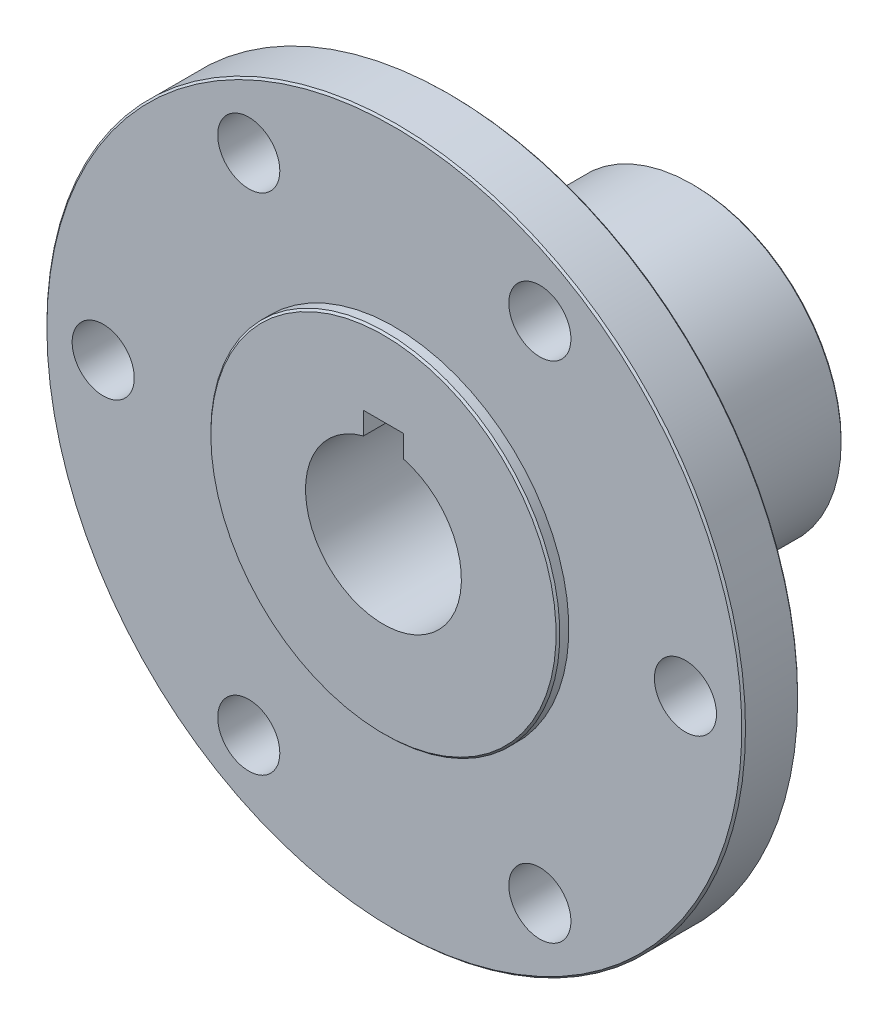
ISO-10303-21;
HEADER;
FILE_DESCRIPTION(('STEP AP214'),'2;1');
FILE_NAME('part.step','',(''),(''),'','','');
FILE_SCHEMA(('AUTOMOTIVE_DESIGN { 1 0 10303 214 1 1 1 1 }'));
ENDSEC;
DATA;
#1=APPLICATION_CONTEXT('core data for automotive mechanical design processes');
#2=APPLICATION_PROTOCOL_DEFINITION('international standard','automotive_design',2000,#1);
#3=PRODUCT_CONTEXT('',#1,'mechanical');
#4=PRODUCT('Part','Part','',(#3));
#5=PRODUCT_RELATED_PRODUCT_CATEGORY('part','',(#4));
#6=PRODUCT_DEFINITION_FORMATION('','',#4);
#7=PRODUCT_DEFINITION_CONTEXT('part definition',#1,'design');
#8=PRODUCT_DEFINITION('design','',#6,#7);
#9=PRODUCT_DEFINITION_SHAPE('','',#8);
#10=(LENGTH_UNIT() NAMED_UNIT(*) SI_UNIT(.MILLI.,.METRE.));
#11=(NAMED_UNIT(*) PLANE_ANGLE_UNIT() SI_UNIT($,.RADIAN.));
#12=(NAMED_UNIT(*) SI_UNIT($,.STERADIAN.) SOLID_ANGLE_UNIT());
#13=UNCERTAINTY_MEASURE_WITH_UNIT(LENGTH_MEASURE(1.E-05),#10,'distance_accuracy_value','');
#14=(GEOMETRIC_REPRESENTATION_CONTEXT(3) GLOBAL_UNCERTAINTY_ASSIGNED_CONTEXT((#13)) GLOBAL_UNIT_ASSIGNED_CONTEXT((#10,
#11,#12)) REPRESENTATION_CONTEXT('',''));
#15=CARTESIAN_POINT('',(0.,0.,0.));
#16=DIRECTION('',(0.,0.,1.));
#17=DIRECTION('',(1.,0.,0.));
#18=AXIS2_PLACEMENT_3D('',#15,#16,#17);
#19=CARTESIAN_POINT('',(0.,0.,-19.05));
#20=DIRECTION('',(0.,0.,-1.));
#21=DIRECTION('',(-1.,0.,0.));
#22=AXIS2_PLACEMENT_3D('',#19,#20,#21);
#23=PLANE('',#22);
#24=DIRECTION('',(0.,-1.,0.));
#25=VECTOR('',#24,1.);
#26=CARTESIAN_POINT('',(1.6256,7.9756,-19.05));
#27=LINE('',#26,#25);
#28=CARTESIAN_POINT('',(1.6256,7.9756,-19.05));
#29=VERTEX_POINT('',#28);
#30=CARTESIAN_POINT('',(1.6256,6.16466948019113,-19.05));
#31=VERTEX_POINT('',#30);
#32=EDGE_CURVE('E60',#29,#31,#27,.T.);
#33=ORIENTED_EDGE('',*,*,#32,.F.);
#34=DIRECTION('',(1.,0.,0.));
#35=VECTOR('',#34,1.);
#36=CARTESIAN_POINT('',(-1.6256,7.9756,-19.05));
#37=LINE('',#36,#35);
#38=CARTESIAN_POINT('',(-1.6256,7.9756,-19.05));
#39=VERTEX_POINT('',#38);
#40=EDGE_CURVE('E86',#39,#29,#37,.T.);
#41=ORIENTED_EDGE('',*,*,#40,.F.);
#42=DIRECTION('',(0.,1.,0.));
#43=VECTOR('',#42,1.);
#44=CARTESIAN_POINT('',(-1.6256,6.16466948019113,-19.05));
#45=LINE('',#44,#43);
#46=CARTESIAN_POINT('',(-1.6256,6.16466948019113,-19.05));
#47=VERTEX_POINT('',#46);
#48=EDGE_CURVE('E62',#47,#39,#45,.T.);
#49=ORIENTED_EDGE('',*,*,#48,.F.);
#50=CARTESIAN_POINT('',(0.,0.,-19.05));
#51=DIRECTION('',(0.,0.,1.));
#52=DIRECTION('',(1.,0.,0.));
#53=AXIS2_PLACEMENT_3D('',#50,#51,#52);
#54=CIRCLE('',#53,6.3754);
#55=EDGE_CURVE('E54',#47,#31,#54,.T.);
#56=ORIENTED_EDGE('',*,*,#55,.T.);
#57=EDGE_LOOP('',(#33,#41,#49,#56));
#58=FACE_BOUND('',#57,.T.);
#59=CARTESIAN_POINT('',(0.,0.,-19.0499999999999));
#60=DIRECTION('',(0.,0.,1.));
#61=DIRECTION('',(1.,0.,0.));
#62=AXIS2_PLACEMENT_3D('',#59,#60,#61);
#63=CIRCLE('',#62,12.0396000000001);
#64=CARTESIAN_POINT('',(12.0396000000001,0.,-19.0499999999999));
#65=VERTEX_POINT('',#64);
#66=EDGE_CURVE('E20',#65,#65,#63,.T.);
#67=ORIENTED_EDGE('',*,*,#66,.F.);
#68=EDGE_LOOP('',(#67));
#69=FACE_BOUND('',#68,.T.);
#70=ADVANCED_FACE('F17',(#58,#69),#23,.T.);
#71=CARTESIAN_POINT('',(0.,0.,-18.8976000000004));
#72=DIRECTION('',(0.,0.,1.));
#73=DIRECTION('',(1.,0.,0.));
#74=AXIS2_PLACEMENT_3D('',#71,#72,#73);
#75=CONICAL_SURFACE('',#74,12.1920000000003,0.785398163399992);
#76=ORIENTED_EDGE('',*,*,#66,.T.);
#77=EDGE_LOOP('',(#76));
#78=FACE_BOUND('',#77,.T.);
#79=CARTESIAN_POINT('',(0.,0.,-18.8976000002541));
#80=DIRECTION('',(0.,0.,-1.));
#81=DIRECTION('',(-1.,0.,0.));
#82=AXIS2_PLACEMENT_3D('',#79,#80,#81);
#83=CIRCLE('',#82,12.192);
#84=CARTESIAN_POINT('',(-12.192,0.,-18.8976000002541));
#85=VERTEX_POINT('',#84);
#86=EDGE_CURVE('E85',#85,#85,#83,.F.);
#87=ORIENTED_EDGE('',*,*,#86,.F.);
#88=EDGE_LOOP('',(#87));
#89=FACE_BOUND('',#88,.T.);
#90=ADVANCED_FACE('F310',(#78,#89),#75,.T.);
#91=CARTESIAN_POINT('',(1.6256,7.9756,6.35));
#92=DIRECTION('',(-1.,0.,0.));
#93=DIRECTION('',(0.,-1.,0.));
#94=AXIS2_PLACEMENT_3D('',#91,#92,#93);
#95=PLANE('',#94);
#96=DIRECTION('',(0.,0.,1.));
#97=VECTOR('',#96,1.);
#98=CARTESIAN_POINT('',(1.6256,6.16466948019113,6.35));
#99=LINE('',#98,#97);
#100=CARTESIAN_POINT('',(1.6256,6.16466948019113,6.35));
#101=VERTEX_POINT('',#100);
#102=EDGE_CURVE('E64',#31,#101,#99,.T.);
#103=ORIENTED_EDGE('',*,*,#102,.T.);
#104=DIRECTION('',(0.,1.,0.));
#105=VECTOR('',#104,1.);
#106=CARTESIAN_POINT('',(1.6256,0.,6.35));
#107=LINE('',#106,#105);
#108=CARTESIAN_POINT('',(1.6256,7.9756,6.35));
#109=VERTEX_POINT('',#108);
#110=EDGE_CURVE('E156',#109,#101,#107,.F.);
#111=ORIENTED_EDGE('',*,*,#110,.F.);
#112=DIRECTION('',(0.,0.,-1.));
#113=VECTOR('',#112,1.);
#114=CARTESIAN_POINT('',(1.6256,7.9756,6.35));
#115=LINE('',#114,#113);
#116=EDGE_CURVE('E70',#29,#109,#115,.F.);
#117=ORIENTED_EDGE('',*,*,#116,.F.);
#118=ORIENTED_EDGE('',*,*,#32,.T.);
#119=EDGE_LOOP('',(#103,#111,#117,#118));
#120=FACE_BOUND('',#119,.T.);
#121=ADVANCED_FACE('F66',(#120),#95,.T.);
#122=CARTESIAN_POINT('',(0.,0.,6.35));
#123=DIRECTION('',(0.,0.,1.));
#124=DIRECTION('',(1.,0.,0.));
#125=AXIS2_PLACEMENT_3D('',#122,#123,#124);
#126=CYLINDRICAL_SURFACE('',#125,6.3754);
#127=ORIENTED_EDGE('',*,*,#102,.F.);
#128=ORIENTED_EDGE('',*,*,#55,.F.);
#129=DIRECTION('',(0.,0.,-1.));
#130=VECTOR('',#129,1.);
#131=CARTESIAN_POINT('',(-1.6256,6.16466948019113,6.35));
#132=LINE('',#131,#130);
#133=CARTESIAN_POINT('',(-1.6256,6.16466948019113,6.35));
#134=VERTEX_POINT('',#133);
#135=EDGE_CURVE('E77',#134,#47,#132,.T.);
#136=ORIENTED_EDGE('',*,*,#135,.F.);
#137=CARTESIAN_POINT('',(0.,0.,6.35));
#138=DIRECTION('',(0.,0.,1.));
#139=DIRECTION('',(1.,0.,0.));
#140=AXIS2_PLACEMENT_3D('',#137,#138,#139);
#141=CIRCLE('',#140,6.3754);
#142=EDGE_CURVE('E75',#101,#134,#141,.F.);
#143=ORIENTED_EDGE('',*,*,#142,.F.);
#144=EDGE_LOOP('',(#127,#128,#136,#143));
#145=FACE_BOUND('',#144,.T.);
#146=ADVANCED_FACE('F73',(#145),#126,.F.);
#147=CARTESIAN_POINT('',(-1.6256,6.16466948019113,6.35));
#148=DIRECTION('',(1.,0.,0.));
#149=DIRECTION('',(0.,0.,-1.));
#150=AXIS2_PLACEMENT_3D('',#147,#148,#149);
#151=PLANE('',#150);
#152=DIRECTION('',(0.,0.,-1.));
#153=VECTOR('',#152,1.);
#154=CARTESIAN_POINT('',(-1.6256,7.9756,6.35));
#155=LINE('',#154,#153);
#156=CARTESIAN_POINT('',(-1.6256,7.9756,6.35));
#157=VERTEX_POINT('',#156);
#158=EDGE_CURVE('E35',#157,#39,#155,.T.);
#159=ORIENTED_EDGE('',*,*,#158,.F.);
#160=DIRECTION('',(0.,1.,0.));
#161=VECTOR('',#160,1.);
#162=CARTESIAN_POINT('',(-1.6256,0.,6.35));
#163=LINE('',#162,#161);
#164=EDGE_CURVE('E155',#134,#157,#163,.T.);
#165=ORIENTED_EDGE('',*,*,#164,.F.);
#166=ORIENTED_EDGE('',*,*,#135,.T.);
#167=ORIENTED_EDGE('',*,*,#48,.T.);
#168=EDGE_LOOP('',(#159,#165,#166,#167));
#169=FACE_BOUND('',#168,.T.);
#170=ADVANCED_FACE('F178',(#169),#151,.T.);
#171=CARTESIAN_POINT('',(-1.6256,7.9756,6.35));
#172=DIRECTION('',(0.,-1.,0.));
#173=DIRECTION('',(0.,0.,-1.));
#174=AXIS2_PLACEMENT_3D('',#171,#172,#173);
#175=PLANE('',#174);
#176=ORIENTED_EDGE('',*,*,#116,.T.);
#177=DIRECTION('',(1.,0.,0.));
#178=VECTOR('',#177,1.);
#179=CARTESIAN_POINT('',(0.,7.9756,6.35));
#180=LINE('',#179,#178);
#181=EDGE_CURVE('E159',#157,#109,#180,.T.);
#182=ORIENTED_EDGE('',*,*,#181,.F.);
#183=ORIENTED_EDGE('',*,*,#158,.T.);
#184=ORIENTED_EDGE('',*,*,#40,.T.);
#185=EDGE_LOOP('',(#176,#182,#183,#184));
#186=FACE_BOUND('',#185,.T.);
#187=ADVANCED_FACE('F175',(#186),#175,.T.);
#188=CARTESIAN_POINT('',(0.,0.,-19.05));
#189=DIRECTION('',(0.,0.,-1.));
#190=DIRECTION('',(-1.,0.,0.));
#191=AXIS2_PLACEMENT_3D('',#188,#189,#190);
#192=CYLINDRICAL_SURFACE('',#191,12.192);
#193=ORIENTED_EDGE('',*,*,#86,.T.);
#194=EDGE_LOOP('',(#193));
#195=FACE_BOUND('',#194,.T.);
#196=CARTESIAN_POINT('',(0.,0.,-0.508000000000048));
#197=DIRECTION('',(0.,0.,1.));
#198=DIRECTION('',(1.,0.,0.));
#199=AXIS2_PLACEMENT_3D('',#196,#197,#198);
#200=CIRCLE('',#199,12.192);
#201=CARTESIAN_POINT('',(12.192,0.,-0.508000000000049));
#202=VERTEX_POINT('',#201);
#203=EDGE_CURVE('E154',#202,#202,#200,.T.);
#204=ORIENTED_EDGE('',*,*,#203,.F.);
#205=EDGE_LOOP('',(#204));
#206=FACE_BOUND('',#205,.T.);
#207=ADVANCED_FACE('F186',(#195,#206),#192,.T.);
#208=CARTESIAN_POINT('',(0.,0.,6.35));
#209=DIRECTION('',(0.,0.,1.));
#210=DIRECTION('',(1.,0.,0.));
#211=AXIS2_PLACEMENT_3D('',#208,#209,#210);
#212=PLANE('',#211);
#213=ORIENTED_EDGE('',*,*,#164,.T.);
#214=ORIENTED_EDGE('',*,*,#181,.T.);
#215=ORIENTED_EDGE('',*,*,#110,.T.);
#216=ORIENTED_EDGE('',*,*,#142,.T.);
#217=EDGE_LOOP('',(#213,#214,#215,#216));
#218=FACE_BOUND('',#217,.T.);
#219=CARTESIAN_POINT('',(0.,0.,6.35));
#220=DIRECTION('',(0.,0.,-1.));
#221=DIRECTION('',(-1.,0.,0.));
#222=AXIS2_PLACEMENT_3D('',#219,#220,#221);
#223=CIRCLE('',#222,14.1224);
#224=CARTESIAN_POINT('',(-14.1224,0.,6.35));
#225=VERTEX_POINT('',#224);
#226=EDGE_CURVE('E151',#225,#225,#223,.T.);
#227=ORIENTED_EDGE('',*,*,#226,.F.);
#228=EDGE_LOOP('',(#227));
#229=FACE_BOUND('',#228,.T.);
#230=ADVANCED_FACE('F176',(#218,#229),#212,.T.);
#231=CARTESIAN_POINT('',(0.,0.,1.25678439009957E-10));
#232=DIRECTION('',(0.,0.,1.));
#233=DIRECTION('',(1.,0.,0.));
#234=AXIS2_PLACEMENT_3D('',#231,#232,#233);
#235=CONICAL_SURFACE('',#234,12.7000000001283,0.7853981634);
#236=ORIENTED_EDGE('',*,*,#203,.T.);
#237=EDGE_LOOP('',(#236));
#238=FACE_BOUND('',#237,.T.);
#239=CARTESIAN_POINT('',(0.,0.,1.25678439009957E-10));
#240=DIRECTION('',(0.,0.,1.));
#241=DIRECTION('',(1.,0.,0.));
#242=AXIS2_PLACEMENT_3D('',#239,#240,#241);
#243=CIRCLE('',#242,12.7000000001283);
#244=CARTESIAN_POINT('',(12.7000000001283,0.,1.25678439009957E-10));
#245=VERTEX_POINT('',#244);
#246=EDGE_CURVE('E147',#245,#245,#243,.F.);
#247=ORIENTED_EDGE('',*,*,#246,.T.);
#248=EDGE_LOOP('',(#247));
#249=FACE_BOUND('',#248,.T.);
#250=ADVANCED_FACE('F256',(#238,#249),#235,.T.);
#251=CARTESIAN_POINT('',(0.,0.,6.19760000000039));
#252=DIRECTION('',(0.,0.,-1.));
#253=DIRECTION('',(-1.,0.,0.));
#254=AXIS2_PLACEMENT_3D('',#251,#252,#253);
#255=CONICAL_SURFACE('',#254,14.2748000000004,0.785398163399998);
#256=ORIENTED_EDGE('',*,*,#226,.T.);
#257=EDGE_LOOP('',(#256));
#258=FACE_BOUND('',#257,.T.);
#259=CARTESIAN_POINT('',(0.,0.,6.19760000025401));
#260=DIRECTION('',(0.,0.,-1.));
#261=DIRECTION('',(-1.,0.,0.));
#262=AXIS2_PLACEMENT_3D('',#259,#260,#261);
#263=CIRCLE('',#262,14.2748);
#264=CARTESIAN_POINT('',(-14.2748,0.,6.19760000025401));
#265=VERTEX_POINT('',#264);
#266=EDGE_CURVE('E150',#265,#265,#263,.T.);
#267=ORIENTED_EDGE('',*,*,#266,.F.);
#268=EDGE_LOOP('',(#267));
#269=FACE_BOUND('',#268,.T.);
#270=ADVANCED_FACE('F252',(#258,#269),#255,.T.);
#271=CARTESIAN_POINT('',(0.,0.,0.));
#272=DIRECTION('',(0.,0.,1.));
#273=DIRECTION('',(1.,0.,0.));
#274=AXIS2_PLACEMENT_3D('',#271,#272,#273);
#275=PLANE('',#274);
#276=ORIENTED_EDGE('',*,*,#246,.F.);
#277=EDGE_LOOP('',(#276));
#278=FACE_BOUND('',#277,.T.);
#279=CARTESIAN_POINT('',(0.,0.,1.27387873470261E-10));
#280=DIRECTION('',(0.,0.,1.));
#281=DIRECTION('',(0.,-1.,0.));
#282=AXIS2_PLACEMENT_3D('',#279,#280,#281);
#283=CIRCLE('',#282,14.1224000001266);
#284=CARTESIAN_POINT('',(0.,-14.1224000001266,1.27387886878099E-10));
#285=VERTEX_POINT('',#284);
#286=EDGE_CURVE('E143',#285,#285,#283,.T.);
#287=ORIENTED_EDGE('',*,*,#286,.F.);
#288=EDGE_LOOP('',(#287));
#289=FACE_BOUND('',#288,.T.);
#290=ADVANCED_FACE('F248',(#278,#289),#275,.F.);
#291=CARTESIAN_POINT('',(0.,0.,5.30860000000038));
#292=DIRECTION('',(0.,0.,-1.));
#293=DIRECTION('',(-1.,0.,0.));
#294=AXIS2_PLACEMENT_3D('',#291,#292,#293);
#295=CONICAL_SURFACE('',#294,28.5750000000004,0.785398163399998);
#296=CARTESIAN_POINT('',(0.,0.,5.461));
#297=DIRECTION('',(0.,0.,-1.));
#298=DIRECTION('',(-1.,0.,0.));
#299=AXIS2_PLACEMENT_3D('',#296,#297,#298);
#300=CIRCLE('',#299,28.4226);
#301=CARTESIAN_POINT('',(-28.4226,0.,5.461));
#302=VERTEX_POINT('',#301);
#303=EDGE_CURVE('E140',#302,#302,#300,.F.);
#304=ORIENTED_EDGE('',*,*,#303,.F.);
#305=EDGE_LOOP('',(#304));
#306=FACE_BOUND('',#305,.T.);
#307=CARTESIAN_POINT('',(0.,0.,5.30860000025399));
#308=DIRECTION('',(0.,0.,1.));
#309=DIRECTION('',(1.,0.,0.));
#310=AXIS2_PLACEMENT_3D('',#307,#308,#309);
#311=CIRCLE('',#310,28.575);
#312=CARTESIAN_POINT('',(28.575,0.,5.30860000025399));
#313=VERTEX_POINT('',#312);
#314=EDGE_CURVE('E146',#313,#313,#311,.F.);
#315=ORIENTED_EDGE('',*,*,#314,.F.);
#316=EDGE_LOOP('',(#315));
#317=FACE_BOUND('',#316,.T.);
#318=ADVANCED_FACE('F244',(#306,#317),#295,.T.);
#319=CARTESIAN_POINT('',(0.,0.,0.));
#320=DIRECTION('',(0.,0.,-1.));
#321=DIRECTION('',(-1.,0.,0.));
#322=AXIS2_PLACEMENT_3D('',#319,#320,#321);
#323=CYLINDRICAL_SURFACE('',#322,14.2748);
#324=CARTESIAN_POINT('',(0.,0.,5.461000000254));
#325=DIRECTION('',(0.,0.,-1.));
#326=DIRECTION('',(-1.,0.,0.));
#327=AXIS2_PLACEMENT_3D('',#324,#325,#326);
#328=CIRCLE('',#327,14.2748);
#329=CARTESIAN_POINT('',(-14.2748,0.,5.461000000254));
#330=VERTEX_POINT('',#329);
#331=EDGE_CURVE('E136',#330,#330,#328,.T.);
#332=ORIENTED_EDGE('',*,*,#331,.F.);
#333=EDGE_LOOP('',(#332));
#334=FACE_BOUND('',#333,.T.);
#335=ORIENTED_EDGE('',*,*,#266,.T.);
#336=EDGE_LOOP('',(#335));
#337=FACE_BOUND('',#336,.T.);
#338=ADVANCED_FACE('F240',(#334,#337),#323,.T.);
#339=CARTESIAN_POINT('',(0.,0.,6.35));
#340=DIRECTION('',(0.,0.,1.));
#341=DIRECTION('',(1.,0.,0.));
#342=AXIS2_PLACEMENT_3D('',#339,#340,#341);
#343=CYLINDRICAL_SURFACE('',#342,28.575);
#344=ORIENTED_EDGE('',*,*,#314,.T.);
#345=EDGE_LOOP('',(#344));
#346=FACE_BOUND('',#345,.T.);
#347=CARTESIAN_POINT('',(0.,0.,1.04140000025362));
#348=DIRECTION('',(0.,0.,1.));
#349=DIRECTION('',(1.,0.,0.));
#350=AXIS2_PLACEMENT_3D('',#347,#348,#349);
#351=CIRCLE('',#350,28.5750000002544);
#352=CARTESIAN_POINT('',(28.5750000002544,0.,1.04140000025362));
#353=VERTEX_POINT('',#352);
#354=EDGE_CURVE('E139',#353,#353,#351,.F.);
#355=ORIENTED_EDGE('',*,*,#354,.F.);
#356=EDGE_LOOP('',(#355));
#357=FACE_BOUND('',#356,.T.);
#358=ADVANCED_FACE('F236',(#346,#357),#343,.T.);
#359=CARTESIAN_POINT('',(0.,0.,0.152400000254));
#360=DIRECTION('',(0.,0.,1.));
#361=DIRECTION('',(0.,-1.,0.));
#362=AXIS2_PLACEMENT_3D('',#359,#360,#361);
#363=CONICAL_SURFACE('',#362,14.274800000254,0.785398163400001);
#364=ORIENTED_EDGE('',*,*,#286,.T.);
#365=EDGE_LOOP('',(#364));
#366=FACE_BOUND('',#365,.T.);
#367=CARTESIAN_POINT('',(0.,0.,0.152400000253999));
#368=DIRECTION('',(0.,0.,-1.));
#369=DIRECTION('',(-1.,0.,0.));
#370=AXIS2_PLACEMENT_3D('',#367,#368,#369);
#371=CIRCLE('',#370,14.2748);
#372=CARTESIAN_POINT('',(-14.2748,0.,0.152400000253999));
#373=VERTEX_POINT('',#372);
#374=EDGE_CURVE('E135',#373,#373,#371,.F.);
#375=ORIENTED_EDGE('',*,*,#374,.F.);
#376=EDGE_LOOP('',(#375));
#377=FACE_BOUND('',#376,.T.);
#378=ADVANCED_FACE('F232',(#366,#377),#363,.T.);
#379=CARTESIAN_POINT('',(-39.6748,0.,5.461));
#380=DIRECTION('',(0.,0.,1.));
#381=DIRECTION('',(1.,0.,0.));
#382=AXIS2_PLACEMENT_3D('',#379,#380,#381);
#383=PLANE('',#382);
#384=CARTESIAN_POINT('',(-11.90625,20.6222299276169,5.461000000254));
#385=DIRECTION('',(0.,0.,1.));
#386=DIRECTION('',(1.,0.,0.));
#387=AXIS2_PLACEMENT_3D('',#384,#385,#386);
#388=CIRCLE('',#387,2.54);
#389=CARTESIAN_POINT('',(-9.36625,20.6222299276169,5.461000000254));
#390=VERTEX_POINT('',#389);
#391=EDGE_CURVE('E117',#390,#390,#388,.F.);
#392=ORIENTED_EDGE('',*,*,#391,.T.);
#393=EDGE_LOOP('',(#392));
#394=FACE_BOUND('',#393,.T.);
#395=CARTESIAN_POINT('',(-23.8125,0.,5.461000000254));
#396=DIRECTION('',(0.,0.,1.));
#397=DIRECTION('',(1.,0.,0.));
#398=AXIS2_PLACEMENT_3D('',#395,#396,#397);
#399=CIRCLE('',#398,2.54);
#400=CARTESIAN_POINT('',(-21.2725,0.,5.461000000254));
#401=VERTEX_POINT('',#400);
#402=EDGE_CURVE('E120',#401,#401,#399,.F.);
#403=ORIENTED_EDGE('',*,*,#402,.T.);
#404=EDGE_LOOP('',(#403));
#405=FACE_BOUND('',#404,.T.);
#406=CARTESIAN_POINT('',(-11.90625,-20.6222299276169,5.461000000254));
#407=DIRECTION('',(0.,0.,1.));
#408=DIRECTION('',(1.,0.,0.));
#409=AXIS2_PLACEMENT_3D('',#406,#407,#408);
#410=CIRCLE('',#409,2.54);
#411=CARTESIAN_POINT('',(-9.36625,-20.6222299276169,5.461000000254));
#412=VERTEX_POINT('',#411);
#413=EDGE_CURVE('E123',#412,#412,#410,.F.);
#414=ORIENTED_EDGE('',*,*,#413,.T.);
#415=EDGE_LOOP('',(#414));
#416=FACE_BOUND('',#415,.T.);
#417=CARTESIAN_POINT('',(11.90625,-20.6222299276169,5.461000000254));
#418=DIRECTION('',(0.,0.,1.));
#419=DIRECTION('',(1.,0.,0.));
#420=AXIS2_PLACEMENT_3D('',#417,#418,#419);
#421=CIRCLE('',#420,2.54);
#422=CARTESIAN_POINT('',(14.44625,-20.6222299276169,5.461000000254));
#423=VERTEX_POINT('',#422);
#424=EDGE_CURVE('E126',#423,#423,#421,.F.);
#425=ORIENTED_EDGE('',*,*,#424,.T.);
#426=EDGE_LOOP('',(#425));
#427=FACE_BOUND('',#426,.T.);
#428=CARTESIAN_POINT('',(23.8125,0.,5.461000000254));
#429=DIRECTION('',(0.,0.,1.));
#430=DIRECTION('',(1.,0.,0.));
#431=AXIS2_PLACEMENT_3D('',#428,#429,#430);
#432=CIRCLE('',#431,2.54);
#433=CARTESIAN_POINT('',(26.3525,0.,5.461000000254));
#434=VERTEX_POINT('',#433);
#435=EDGE_CURVE('E129',#434,#434,#432,.F.);
#436=ORIENTED_EDGE('',*,*,#435,.T.);
#437=EDGE_LOOP('',(#436));
#438=FACE_BOUND('',#437,.T.);
#439=CARTESIAN_POINT('',(11.90625,20.6222299276169,5.461000000254));
#440=DIRECTION('',(0.,0.,1.));
#441=DIRECTION('',(1.,0.,0.));
#442=AXIS2_PLACEMENT_3D('',#439,#440,#441);
#443=CIRCLE('',#442,2.54);
#444=CARTESIAN_POINT('',(14.44625,20.6222299276169,5.461000000254));
#445=VERTEX_POINT('',#444);
#446=EDGE_CURVE('E132',#445,#445,#443,.F.);
#447=ORIENTED_EDGE('',*,*,#446,.T.);
#448=EDGE_LOOP('',(#447));
#449=FACE_BOUND('',#448,.T.);
#450=ORIENTED_EDGE('',*,*,#331,.T.);
#451=EDGE_LOOP('',(#450));
#452=FACE_BOUND('',#451,.T.);
#453=ORIENTED_EDGE('',*,*,#303,.T.);
#454=EDGE_LOOP('',(#453));
#455=FACE_BOUND('',#454,.T.);
#456=ADVANCED_FACE('F228',(#394,#405,#416,#427,#438,#449,#452,#455),#383,.T.);
#457=CARTESIAN_POINT('',(0.,0.,1.04140000025362));
#458=DIRECTION('',(0.,0.,1.));
#459=DIRECTION('',(1.,0.,0.));
#460=AXIS2_PLACEMENT_3D('',#457,#458,#459);
#461=CONICAL_SURFACE('',#460,28.5750000002544,0.785398163399998);
#462=CARTESIAN_POINT('',(0.,0.,0.889000000254001));
#463=DIRECTION('',(0.,0.,1.));
#464=DIRECTION('',(1.,0.,0.));
#465=AXIS2_PLACEMENT_3D('',#462,#463,#464);
#466=CIRCLE('',#465,28.422600000254);
#467=CARTESIAN_POINT('',(28.422600000254,0.,0.889000000254001));
#468=VERTEX_POINT('',#467);
#469=EDGE_CURVE('E114',#468,#468,#466,.F.);
#470=ORIENTED_EDGE('',*,*,#469,.F.);
#471=EDGE_LOOP('',(#470));
#472=FACE_BOUND('',#471,.T.);
#473=ORIENTED_EDGE('',*,*,#354,.T.);
#474=EDGE_LOOP('',(#473));
#475=FACE_BOUND('',#474,.T.);
#476=ADVANCED_FACE('F224',(#472,#475),#461,.T.);
#477=CARTESIAN_POINT('',(0.,0.,0.));
#478=DIRECTION('',(0.,0.,-1.));
#479=DIRECTION('',(-1.,0.,0.));
#480=AXIS2_PLACEMENT_3D('',#477,#478,#479);
#481=CYLINDRICAL_SURFACE('',#480,14.2748);
#482=ORIENTED_EDGE('',*,*,#374,.T.);
#483=EDGE_LOOP('',(#482));
#484=FACE_BOUND('',#483,.T.);
#485=CARTESIAN_POINT('',(0.,0.,0.889000000254));
#486=DIRECTION('',(0.,0.,-1.));
#487=DIRECTION('',(-1.,0.,0.));
#488=AXIS2_PLACEMENT_3D('',#485,#486,#487);
#489=CIRCLE('',#488,14.2748);
#490=CARTESIAN_POINT('',(-14.2748,0.,0.889000000254));
#491=VERTEX_POINT('',#490);
#492=EDGE_CURVE('E111',#491,#491,#489,.F.);
#493=ORIENTED_EDGE('',*,*,#492,.F.);
#494=EDGE_LOOP('',(#493));
#495=FACE_BOUND('',#494,.T.);
#496=ADVANCED_FACE('F220',(#484,#495),#481,.T.);
#497=CARTESIAN_POINT('',(11.90625,20.6222299276169,6.35));
#498=DIRECTION('',(0.,0.,1.));
#499=DIRECTION('',(1.,0.,0.));
#500=AXIS2_PLACEMENT_3D('',#497,#498,#499);
#501=CYLINDRICAL_SURFACE('',#500,2.54);
#502=ORIENTED_EDGE('',*,*,#446,.F.);
#503=EDGE_LOOP('',(#502));
#504=FACE_BOUND('',#503,.T.);
#505=CARTESIAN_POINT('',(11.90625,20.6222299276169,0.889000000254));
#506=DIRECTION('',(0.,0.,1.));
#507=DIRECTION('',(1.,0.,0.));
#508=AXIS2_PLACEMENT_3D('',#505,#506,#507);
#509=CIRCLE('',#508,2.54);
#510=CARTESIAN_POINT('',(14.44625,20.6222299276169,0.889000000254));
#511=VERTEX_POINT('',#510);
#512=EDGE_CURVE('E108',#511,#511,#509,.T.);
#513=ORIENTED_EDGE('',*,*,#512,.F.);
#514=EDGE_LOOP('',(#513));
#515=FACE_BOUND('',#514,.T.);
#516=ADVANCED_FACE('F216',(#504,#515),#501,.F.);
#517=CARTESIAN_POINT('',(23.8125,0.,6.35));
#518=DIRECTION('',(0.,0.,1.));
#519=DIRECTION('',(1.,0.,0.));
#520=AXIS2_PLACEMENT_3D('',#517,#518,#519);
#521=CYLINDRICAL_SURFACE('',#520,2.54);
#522=ORIENTED_EDGE('',*,*,#435,.F.);
#523=EDGE_LOOP('',(#522));
#524=FACE_BOUND('',#523,.T.);
#525=CARTESIAN_POINT('',(23.8125,0.,0.889000000254));
#526=DIRECTION('',(0.,0.,1.));
#527=DIRECTION('',(1.,0.,0.));
#528=AXIS2_PLACEMENT_3D('',#525,#526,#527);
#529=CIRCLE('',#528,2.54);
#530=CARTESIAN_POINT('',(26.3525,0.,0.889000000254));
#531=VERTEX_POINT('',#530);
#532=EDGE_CURVE('E105',#531,#531,#529,.T.);
#533=ORIENTED_EDGE('',*,*,#532,.F.);
#534=EDGE_LOOP('',(#533));
#535=FACE_BOUND('',#534,.T.);
#536=ADVANCED_FACE('F212',(#524,#535),#521,.F.);
#537=CARTESIAN_POINT('',(11.90625,-20.6222299276169,6.35));
#538=DIRECTION('',(0.,0.,1.));
#539=DIRECTION('',(1.,0.,0.));
#540=AXIS2_PLACEMENT_3D('',#537,#538,#539);
#541=CYLINDRICAL_SURFACE('',#540,2.54);
#542=ORIENTED_EDGE('',*,*,#424,.F.);
#543=EDGE_LOOP('',(#542));
#544=FACE_BOUND('',#543,.T.);
#545=CARTESIAN_POINT('',(11.90625,-20.6222299276169,0.889000000254));
#546=DIRECTION('',(0.,0.,1.));
#547=DIRECTION('',(1.,0.,0.));
#548=AXIS2_PLACEMENT_3D('',#545,#546,#547);
#549=CIRCLE('',#548,2.54);
#550=CARTESIAN_POINT('',(14.44625,-20.6222299276169,0.889000000254));
#551=VERTEX_POINT('',#550);
#552=EDGE_CURVE('E102',#551,#551,#549,.T.);
#553=ORIENTED_EDGE('',*,*,#552,.F.);
#554=EDGE_LOOP('',(#553));
#555=FACE_BOUND('',#554,.T.);
#556=ADVANCED_FACE('F208',(#544,#555),#541,.F.);
#557=CARTESIAN_POINT('',(-11.90625,-20.6222299276169,6.35));
#558=DIRECTION('',(0.,0.,1.));
#559=DIRECTION('',(1.,0.,0.));
#560=AXIS2_PLACEMENT_3D('',#557,#558,#559);
#561=CYLINDRICAL_SURFACE('',#560,2.54);
#562=ORIENTED_EDGE('',*,*,#413,.F.);
#563=EDGE_LOOP('',(#562));
#564=FACE_BOUND('',#563,.T.);
#565=CARTESIAN_POINT('',(-11.90625,-20.6222299276169,0.889000000254));
#566=DIRECTION('',(0.,0.,1.));
#567=DIRECTION('',(1.,0.,0.));
#568=AXIS2_PLACEMENT_3D('',#565,#566,#567);
#569=CIRCLE('',#568,2.54);
#570=CARTESIAN_POINT('',(-9.36625,-20.6222299276169,0.889000000254));
#571=VERTEX_POINT('',#570);
#572=EDGE_CURVE('E99',#571,#571,#569,.T.);
#573=ORIENTED_EDGE('',*,*,#572,.F.);
#574=EDGE_LOOP('',(#573));
#575=FACE_BOUND('',#574,.T.);
#576=ADVANCED_FACE('F204',(#564,#575),#561,.F.);
#577=CARTESIAN_POINT('',(-23.8125,0.,6.35));
#578=DIRECTION('',(0.,0.,1.));
#579=DIRECTION('',(1.,0.,0.));
#580=AXIS2_PLACEMENT_3D('',#577,#578,#579);
#581=CYLINDRICAL_SURFACE('',#580,2.54);
#582=ORIENTED_EDGE('',*,*,#402,.F.);
#583=EDGE_LOOP('',(#582));
#584=FACE_BOUND('',#583,.T.);
#585=CARTESIAN_POINT('',(-23.8125,0.,0.889000000254));
#586=DIRECTION('',(0.,0.,1.));
#587=DIRECTION('',(1.,0.,0.));
#588=AXIS2_PLACEMENT_3D('',#585,#586,#587);
#589=CIRCLE('',#588,2.54);
#590=CARTESIAN_POINT('',(-21.2725,0.,0.889000000254));
#591=VERTEX_POINT('',#590);
#592=EDGE_CURVE('E26',#591,#591,#589,.T.);
#593=ORIENTED_EDGE('',*,*,#592,.F.);
#594=EDGE_LOOP('',(#593));
#595=FACE_BOUND('',#594,.T.);
#596=ADVANCED_FACE('F197',(#584,#595),#581,.F.);
#597=CARTESIAN_POINT('',(-11.90625,20.6222299276169,6.35));
#598=DIRECTION('',(0.,0.,1.));
#599=DIRECTION('',(1.,0.,0.));
#600=AXIS2_PLACEMENT_3D('',#597,#598,#599);
#601=CYLINDRICAL_SURFACE('',#600,2.54);
#602=ORIENTED_EDGE('',*,*,#391,.F.);
#603=EDGE_LOOP('',(#602));
#604=FACE_BOUND('',#603,.T.);
#605=CARTESIAN_POINT('',(-11.90625,20.6222299276169,0.889000000254));
#606=DIRECTION('',(0.,0.,1.));
#607=DIRECTION('',(1.,0.,0.));
#608=AXIS2_PLACEMENT_3D('',#605,#606,#607);
#609=CIRCLE('',#608,2.54);
#610=CARTESIAN_POINT('',(-9.36625,20.6222299276169,0.889000000254));
#611=VERTEX_POINT('',#610);
#612=EDGE_CURVE('E11',#611,#611,#609,.T.);
#613=ORIENTED_EDGE('',*,*,#612,.F.);
#614=EDGE_LOOP('',(#613));
#615=FACE_BOUND('',#614,.T.);
#616=ADVANCED_FACE('F191',(#604,#615),#601,.F.);
#617=CARTESIAN_POINT('',(-39.6748,0.,0.889));
#618=DIRECTION('',(0.,0.,-1.));
#619=DIRECTION('',(-1.,0.,0.));
#620=AXIS2_PLACEMENT_3D('',#617,#618,#619);
#621=PLANE('',#620);
#622=ORIENTED_EDGE('',*,*,#612,.T.);
#623=EDGE_LOOP('',(#622));
#624=FACE_BOUND('',#623,.T.);
#625=ORIENTED_EDGE('',*,*,#592,.T.);
#626=EDGE_LOOP('',(#625));
#627=FACE_BOUND('',#626,.T.);
#628=ORIENTED_EDGE('',*,*,#572,.T.);
#629=EDGE_LOOP('',(#628));
#630=FACE_BOUND('',#629,.T.);
#631=ORIENTED_EDGE('',*,*,#552,.T.);
#632=EDGE_LOOP('',(#631));
#633=FACE_BOUND('',#632,.T.);
#634=ORIENTED_EDGE('',*,*,#532,.T.);
#635=EDGE_LOOP('',(#634));
#636=FACE_BOUND('',#635,.T.);
#637=ORIENTED_EDGE('',*,*,#512,.T.);
#638=EDGE_LOOP('',(#637));
#639=FACE_BOUND('',#638,.T.);
#640=ORIENTED_EDGE('',*,*,#492,.T.);
#641=EDGE_LOOP('',(#640));
#642=FACE_BOUND('',#641,.T.);
#643=ORIENTED_EDGE('',*,*,#469,.T.);
#644=EDGE_LOOP('',(#643));
#645=FACE_BOUND('',#644,.T.);
#646=ADVANCED_FACE('F189',(#624,#627,#630,#633,#636,#639,#642,#645),#621,.T.);
#647=CLOSED_SHELL('',(#70,#90,#121,#146,#170,#187,#207,#230,#250,#270,#290,#318,#338,#358,#378,
#456,#476,#496,#516,#536,#556,#576,#596,#616,#646));
#648=MANIFOLD_SOLID_BREP('B1',#647);
#649=ADVANCED_BREP_SHAPE_REPRESENTATION('',(#18,#648),#14);
#650=SHAPE_DEFINITION_REPRESENTATION(#9,#649);
ENDSEC;
END-ISO-10303-21;
